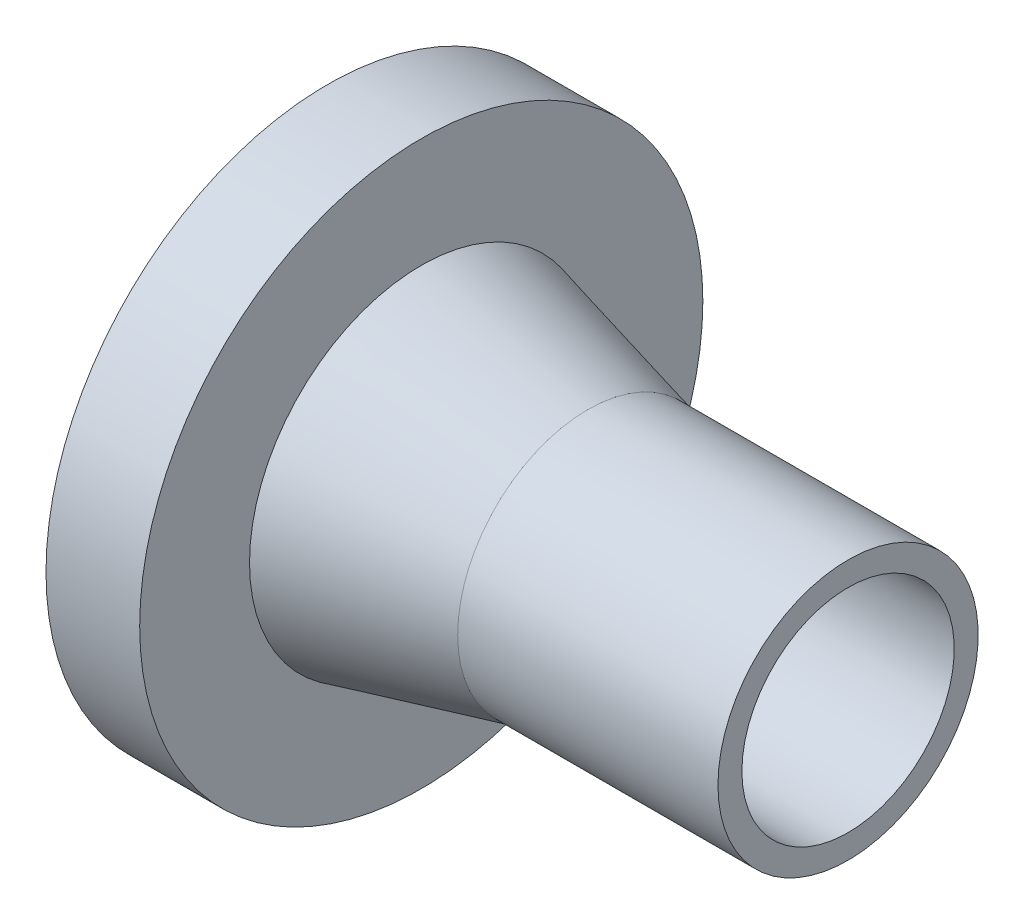
ISO-10303-21;
HEADER;
FILE_DESCRIPTION(('STEP AP214'),'2;1');
FILE_NAME('part.step','',(''),(''),'','','');
FILE_SCHEMA(('AUTOMOTIVE_DESIGN { 1 0 10303 214 1 1 1 1 }'));
ENDSEC;
DATA;
#1=APPLICATION_CONTEXT('core data for automotive mechanical design processes');
#2=APPLICATION_PROTOCOL_DEFINITION('international standard','automotive_design',2000,#1);
#3=PRODUCT_CONTEXT('',#1,'mechanical');
#4=PRODUCT('Part','Part','',(#3));
#5=PRODUCT_RELATED_PRODUCT_CATEGORY('part','',(#4));
#6=PRODUCT_DEFINITION_FORMATION('','',#4);
#7=PRODUCT_DEFINITION_CONTEXT('part definition',#1,'design');
#8=PRODUCT_DEFINITION('design','',#6,#7);
#9=PRODUCT_DEFINITION_SHAPE('','',#8);
#10=(LENGTH_UNIT() NAMED_UNIT(*) SI_UNIT(.MILLI.,.METRE.));
#11=(NAMED_UNIT(*) PLANE_ANGLE_UNIT() SI_UNIT($,.RADIAN.));
#12=(NAMED_UNIT(*) SI_UNIT($,.STERADIAN.) SOLID_ANGLE_UNIT());
#13=UNCERTAINTY_MEASURE_WITH_UNIT(LENGTH_MEASURE(1.E-05),#10,'distance_accuracy_value','');
#14=(GEOMETRIC_REPRESENTATION_CONTEXT(3) GLOBAL_UNCERTAINTY_ASSIGNED_CONTEXT((#13)) GLOBAL_UNIT_ASSIGNED_CONTEXT((#10,
#11,#12)) REPRESENTATION_CONTEXT('',''));
#15=CARTESIAN_POINT('',(0.,0.,0.));
#16=DIRECTION('',(0.,0.,1.));
#17=DIRECTION('',(1.,0.,0.));
#18=AXIS2_PLACEMENT_3D('',#15,#16,#17);
#19=CARTESIAN_POINT('',(-25.,0.,0.));
#20=DIRECTION('',(-1.,0.,0.));
#21=DIRECTION('',(0.,0.,1.));
#22=AXIS2_PLACEMENT_3D('',#19,#20,#21);
#23=CONICAL_SURFACE('',#22,12.5,0.244978663126864);
#24=CARTESIAN_POINT('',(-41.,0.,0.));
#25=DIRECTION('',(-1.,0.,0.));
#26=DIRECTION('',(0.,0.,1.));
#27=AXIS2_PLACEMENT_3D('',#24,#25,#26);
#28=CIRCLE('',#27,16.5);
#29=CARTESIAN_POINT('',(-41.,0.,16.5));
#30=VERTEX_POINT('',#29);
#31=EDGE_CURVE('E16',#30,#30,#28,.T.);
#32=ORIENTED_EDGE('',*,*,#31,.F.);
#33=EDGE_LOOP('',(#32));
#34=FACE_BOUND('',#33,.T.);
#35=CARTESIAN_POINT('',(-25.,0.,0.));
#36=DIRECTION('',(-1.,0.,0.));
#37=DIRECTION('',(0.,1.,0.));
#38=AXIS2_PLACEMENT_3D('',#35,#36,#37);
#39=CIRCLE('',#38,12.5);
#40=CARTESIAN_POINT('',(-25.,12.5,0.));
#41=VERTEX_POINT('',#40);
#42=EDGE_CURVE('E28',#41,#41,#39,.F.);
#43=ORIENTED_EDGE('',*,*,#42,.F.);
#44=EDGE_LOOP('',(#43));
#45=FACE_BOUND('',#44,.T.);
#46=ADVANCED_FACE('F13',(#34,#45),#23,.T.);
#47=CARTESIAN_POINT('',(-41.,27.05,27.3746010541544));
#48=DIRECTION('',(1.,0.,0.));
#49=DIRECTION('',(0.,-1.,0.));
#50=AXIS2_PLACEMENT_3D('',#47,#48,#49);
#51=PLANE('',#50);
#52=ORIENTED_EDGE('',*,*,#31,.T.);
#53=EDGE_LOOP('',(#52));
#54=FACE_BOUND('',#53,.T.);
#55=CARTESIAN_POINT('',(-41.,0.,0.));
#56=DIRECTION('',(-1.,0.,0.));
#57=DIRECTION('',(0.,0.,1.));
#58=AXIS2_PLACEMENT_3D('',#55,#56,#57);
#59=CIRCLE('',#58,27.05);
#60=CARTESIAN_POINT('',(-41.,0.,27.05));
#61=VERTEX_POINT('',#60);
#62=EDGE_CURVE('E34',#61,#61,#59,.T.);
#63=ORIENTED_EDGE('',*,*,#62,.F.);
#64=EDGE_LOOP('',(#63));
#65=FACE_BOUND('',#64,.T.);
#66=ADVANCED_FACE('F44',(#54,#65),#51,.T.);
#67=CARTESIAN_POINT('',(-25.,0.,0.));
#68=DIRECTION('',(-1.,0.,0.));
#69=DIRECTION('',(0.,0.,1.));
#70=AXIS2_PLACEMENT_3D('',#67,#68,#69);
#71=CYLINDRICAL_SURFACE('',#70,12.5);
#72=ORIENTED_EDGE('',*,*,#42,.T.);
#73=EDGE_LOOP('',(#72));
#74=FACE_BOUND('',#73,.T.);
#75=CARTESIAN_POINT('',(0.,0.,0.));
#76=DIRECTION('',(-1.,0.,0.));
#77=DIRECTION('',(0.,0.,1.));
#78=AXIS2_PLACEMENT_3D('',#75,#76,#77);
#79=CIRCLE('',#78,12.5);
#80=CARTESIAN_POINT('',(0.,0.,12.5));
#81=VERTEX_POINT('',#80);
#82=EDGE_CURVE('E32',#81,#81,#79,.F.);
#83=ORIENTED_EDGE('',*,*,#82,.F.);
#84=EDGE_LOOP('',(#83));
#85=FACE_BOUND('',#84,.T.);
#86=ADVANCED_FACE('F53',(#74,#85),#71,.T.);
#87=CARTESIAN_POINT('',(-50.,0.,0.));
#88=DIRECTION('',(-1.,0.,0.));
#89=DIRECTION('',(0.,0.,1.));
#90=AXIS2_PLACEMENT_3D('',#87,#88,#89);
#91=CYLINDRICAL_SURFACE('',#90,27.05);
#92=CARTESIAN_POINT('',(-50.,0.,0.));
#93=DIRECTION('',(-1.,0.,0.));
#94=DIRECTION('',(0.,0.,1.));
#95=AXIS2_PLACEMENT_3D('',#92,#93,#94);
#96=CIRCLE('',#95,27.05);
#97=CARTESIAN_POINT('',(-50.,0.,27.05));
#98=VERTEX_POINT('',#97);
#99=EDGE_CURVE('E25',#98,#98,#96,.T.);
#100=ORIENTED_EDGE('',*,*,#99,.F.);
#101=EDGE_LOOP('',(#100));
#102=FACE_BOUND('',#101,.T.);
#103=ORIENTED_EDGE('',*,*,#62,.T.);
#104=EDGE_LOOP('',(#103));
#105=FACE_BOUND('',#104,.T.);
#106=ADVANCED_FACE('F68',(#102,#105),#91,.T.);
#107=CARTESIAN_POINT('',(0.,12.5,12.6500021083112));
#108=DIRECTION('',(1.,0.,0.));
#109=DIRECTION('',(0.,-1.,0.));
#110=AXIS2_PLACEMENT_3D('',#107,#108,#109);
#111=PLANE('',#110);
#112=CARTESIAN_POINT('',(0.,0.,0.));
#113=DIRECTION('',(-1.,0.,0.));
#114=DIRECTION('',(0.,0.,1.));
#115=AXIS2_PLACEMENT_3D('',#112,#113,#114);
#116=CIRCLE('',#115,10.2);
#117=CARTESIAN_POINT('',(0.,0.,10.2));
#118=VERTEX_POINT('',#117);
#119=EDGE_CURVE('E20',#118,#118,#116,.F.);
#120=ORIENTED_EDGE('',*,*,#119,.F.);
#121=EDGE_LOOP('',(#120));
#122=FACE_BOUND('',#121,.T.);
#123=ORIENTED_EDGE('',*,*,#82,.T.);
#124=EDGE_LOOP('',(#123));
#125=FACE_BOUND('',#124,.T.);
#126=ADVANCED_FACE('F62',(#122,#125),#111,.T.);
#127=CARTESIAN_POINT('',(-50.,-27.05,27.3746010541544));
#128=DIRECTION('',(-1.,0.,0.));
#129=DIRECTION('',(0.,1.,0.));
#130=AXIS2_PLACEMENT_3D('',#127,#128,#129);
#131=PLANE('',#130);
#132=CARTESIAN_POINT('',(-50.,0.,0.));
#133=DIRECTION('',(-1.,0.,0.));
#134=DIRECTION('',(0.,0.,1.));
#135=AXIS2_PLACEMENT_3D('',#132,#133,#134);
#136=CIRCLE('',#135,10.2);
#137=CARTESIAN_POINT('',(-50.,0.,10.2));
#138=VERTEX_POINT('',#137);
#139=EDGE_CURVE('E8',#138,#138,#136,.T.);
#140=ORIENTED_EDGE('',*,*,#139,.F.);
#141=EDGE_LOOP('',(#140));
#142=FACE_BOUND('',#141,.T.);
#143=ORIENTED_EDGE('',*,*,#99,.T.);
#144=EDGE_LOOP('',(#143));
#145=FACE_BOUND('',#144,.T.);
#146=ADVANCED_FACE('F56',(#142,#145),#131,.T.);
#147=CARTESIAN_POINT('',(0.,0.,0.));
#148=DIRECTION('',(-1.,0.,0.));
#149=DIRECTION('',(0.,0.,1.));
#150=AXIS2_PLACEMENT_3D('',#147,#148,#149);
#151=CYLINDRICAL_SURFACE('',#150,10.2);
#152=ORIENTED_EDGE('',*,*,#119,.T.);
#153=EDGE_LOOP('',(#152));
#154=FACE_BOUND('',#153,.T.);
#155=ORIENTED_EDGE('',*,*,#139,.T.);
#156=EDGE_LOOP('',(#155));
#157=FACE_BOUND('',#156,.T.);
#158=ADVANCED_FACE('F54',(#154,#157),#151,.F.);
#159=CLOSED_SHELL('',(#46,#66,#86,#106,#126,#146,#158));
#160=MANIFOLD_SOLID_BREP('B1',#159);
#161=ADVANCED_BREP_SHAPE_REPRESENTATION('',(#18,#160),#14);
#162=SHAPE_DEFINITION_REPRESENTATION(#9,#161);
ENDSEC;
END-ISO-10303-21;
